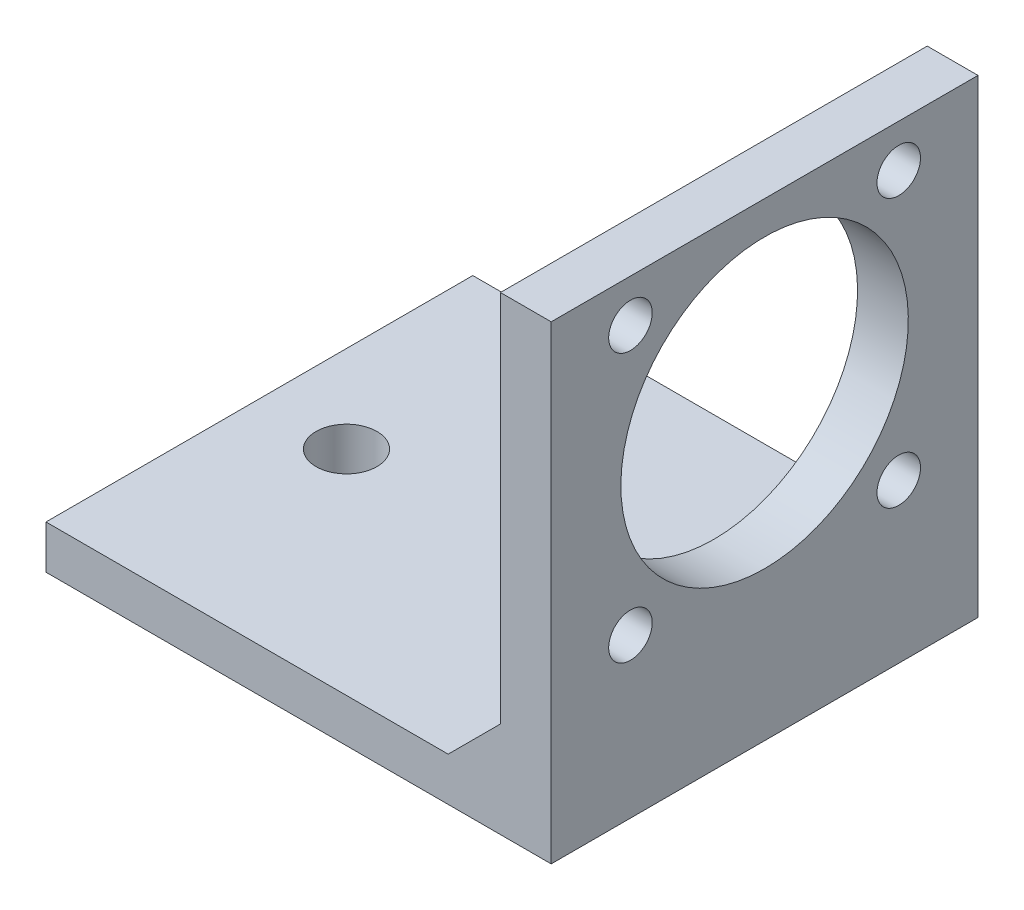
ISO-10303-21;
HEADER;
FILE_DESCRIPTION(('STEP AP214'),'2;1');
FILE_NAME('part.step','',(''),(''),'','','');
FILE_SCHEMA(('AUTOMOTIVE_DESIGN { 1 0 10303 214 1 1 1 1 }'));
ENDSEC;
DATA;
#1=APPLICATION_CONTEXT('core data for automotive mechanical design processes');
#2=APPLICATION_PROTOCOL_DEFINITION('international standard','automotive_design',2000,#1);
#3=PRODUCT_CONTEXT('',#1,'mechanical');
#4=PRODUCT('Part','Part','',(#3));
#5=PRODUCT_RELATED_PRODUCT_CATEGORY('part','',(#4));
#6=PRODUCT_DEFINITION_FORMATION('','',#4);
#7=PRODUCT_DEFINITION_CONTEXT('part definition',#1,'design');
#8=PRODUCT_DEFINITION('design','',#6,#7);
#9=PRODUCT_DEFINITION_SHAPE('','',#8);
#10=(LENGTH_UNIT() NAMED_UNIT(*) SI_UNIT(.MILLI.,.METRE.));
#11=(NAMED_UNIT(*) PLANE_ANGLE_UNIT() SI_UNIT($,.RADIAN.));
#12=(NAMED_UNIT(*) SI_UNIT($,.STERADIAN.) SOLID_ANGLE_UNIT());
#13=UNCERTAINTY_MEASURE_WITH_UNIT(LENGTH_MEASURE(1.E-05),#10,'distance_accuracy_value','');
#14=(GEOMETRIC_REPRESENTATION_CONTEXT(3) GLOBAL_UNCERTAINTY_ASSIGNED_CONTEXT((#13)) GLOBAL_UNIT_ASSIGNED_CONTEXT((#10,
#11,#12)) REPRESENTATION_CONTEXT('',''));
#15=CARTESIAN_POINT('',(0.,0.,0.));
#16=DIRECTION('',(0.,0.,1.));
#17=DIRECTION('',(1.,0.,0.));
#18=AXIS2_PLACEMENT_3D('',#15,#16,#17);
#19=CARTESIAN_POINT('',(26.085652445732,0.,24.5));
#20=DIRECTION('',(-1.,0.,0.));
#21=DIRECTION('',(0.,-1.,0.));
#22=AXIS2_PLACEMENT_3D('',#19,#20,#21);
#23=PLANE('',#22);
#24=DIRECTION('',(0.,1.,0.));
#25=VECTOR('',#24,1.);
#26=CARTESIAN_POINT('',(26.085652445732,0.,0.));
#27=LINE('',#26,#25);
#28=CARTESIAN_POINT('',(26.085652445732,5.5,0.));
#29=VERTEX_POINT('',#28);
#30=CARTESIAN_POINT('',(26.0856524457321,26.95,0.));
#31=VERTEX_POINT('',#30);
#32=EDGE_CURVE('E96',#29,#31,#27,.T.);
#33=ORIENTED_EDGE('',*,*,#32,.F.);
#34=DIRECTION('',(0.,0.,1.));
#35=VECTOR('',#34,1.);
#36=CARTESIAN_POINT('',(26.085652445732,5.5,24.5));
#37=LINE('',#36,#35);
#38=CARTESIAN_POINT('',(26.085652445732,5.5,24.5));
#39=VERTEX_POINT('',#38);
#40=EDGE_CURVE('E56',#29,#39,#37,.T.);
#41=ORIENTED_EDGE('',*,*,#40,.T.);
#42=DIRECTION('',(0.,1.,0.));
#43=VECTOR('',#42,1.);
#44=CARTESIAN_POINT('',(26.085652445732,0.,24.5));
#45=LINE('',#44,#43);
#46=CARTESIAN_POINT('',(26.0856524457321,26.95,24.5));
#47=VERTEX_POINT('',#46);
#48=EDGE_CURVE('E116',#39,#47,#45,.T.);
#49=ORIENTED_EDGE('',*,*,#48,.T.);
#50=DIRECTION('',(0.,0.,1.));
#51=VECTOR('',#50,1.);
#52=CARTESIAN_POINT('',(26.0856524457321,26.95,0.));
#53=LINE('',#52,#51);
#54=EDGE_CURVE('E109',#31,#47,#53,.T.);
#55=ORIENTED_EDGE('',*,*,#54,.F.);
#56=EDGE_LOOP('',(#33,#41,#49,#55));
#57=FACE_BOUND('',#56,.T.);
#58=CARTESIAN_POINT('',(26.0856524457321,16.8,12.25));
#59=DIRECTION('',(-1.,0.,0.));
#60=DIRECTION('',(0.,-1.,0.));
#61=AXIS2_PLACEMENT_3D('',#58,#59,#60);
#62=CIRCLE('',#61,8.24999999999999);
#63=CARTESIAN_POINT('',(26.0856524457321,8.55,12.25));
#64=VERTEX_POINT('',#63);
#65=EDGE_CURVE('E124',#64,#64,#62,.T.);
#66=ORIENTED_EDGE('',*,*,#65,.F.);
#67=EDGE_LOOP('',(#66));
#68=FACE_BOUND('',#67,.T.);
#69=CARTESIAN_POINT('',(26.085652445732,9.1,19.95));
#70=DIRECTION('',(-1.,0.,0.));
#71=DIRECTION('',(0.,-1.,0.));
#72=AXIS2_PLACEMENT_3D('',#69,#70,#71);
#73=CIRCLE('',#72,1.25);
#74=CARTESIAN_POINT('',(26.085652445732,7.85,19.95));
#75=VERTEX_POINT('',#74);
#76=EDGE_CURVE('E104',#75,#75,#73,.T.);
#77=ORIENTED_EDGE('',*,*,#76,.F.);
#78=EDGE_LOOP('',(#77));
#79=FACE_BOUND('',#78,.T.);
#80=CARTESIAN_POINT('',(26.085652445732,9.1,4.55));
#81=DIRECTION('',(-1.,0.,0.));
#82=DIRECTION('',(0.,-1.,0.));
#83=AXIS2_PLACEMENT_3D('',#80,#81,#82);
#84=CIRCLE('',#83,1.25);
#85=CARTESIAN_POINT('',(26.085652445732,7.85,4.55));
#86=VERTEX_POINT('',#85);
#87=EDGE_CURVE('E157',#86,#86,#84,.T.);
#88=ORIENTED_EDGE('',*,*,#87,.F.);
#89=EDGE_LOOP('',(#88));
#90=FACE_BOUND('',#89,.T.);
#91=CARTESIAN_POINT('',(26.0856524457321,24.5,4.55));
#92=DIRECTION('',(-1.,0.,0.));
#93=DIRECTION('',(0.,-1.,0.));
#94=AXIS2_PLACEMENT_3D('',#91,#92,#93);
#95=CIRCLE('',#94,1.25);
#96=CARTESIAN_POINT('',(26.0856524457321,23.25,4.55));
#97=VERTEX_POINT('',#96);
#98=EDGE_CURVE('E154',#97,#97,#95,.T.);
#99=ORIENTED_EDGE('',*,*,#98,.F.);
#100=EDGE_LOOP('',(#99));
#101=FACE_BOUND('',#100,.T.);
#102=CARTESIAN_POINT('',(26.0856524457321,24.5,19.95));
#103=DIRECTION('',(-1.,0.,0.));
#104=DIRECTION('',(0.,-1.,0.));
#105=AXIS2_PLACEMENT_3D('',#102,#103,#104);
#106=CIRCLE('',#105,1.25);
#107=CARTESIAN_POINT('',(26.0856524457321,23.25,19.95));
#108=VERTEX_POINT('',#107);
#109=EDGE_CURVE('E151',#108,#108,#106,.T.);
#110=ORIENTED_EDGE('',*,*,#109,.F.);
#111=EDGE_LOOP('',(#110));
#112=FACE_BOUND('',#111,.T.);
#113=ADVANCED_FACE('F40',(#57,#68,#79,#90,#101,#112),#23,.T.);
#114=CARTESIAN_POINT('',(0.,2.5,24.5));
#115=DIRECTION('',(0.,1.,0.));
#116=DIRECTION('',(-1.,0.,0.));
#117=AXIS2_PLACEMENT_3D('',#114,#115,#116);
#118=PLANE('',#117);
#119=CARTESIAN_POINT('',(5.,2.5,12.25));
#120=DIRECTION('',(0.,1.,0.));
#121=DIRECTION('',(-1.,0.,0.));
#122=AXIS2_PLACEMENT_3D('',#119,#120,#121);
#123=CIRCLE('',#122,1.75);
#124=CARTESIAN_POINT('',(3.25,2.5,12.25));
#125=VERTEX_POINT('',#124);
#126=EDGE_CURVE('E136',#125,#125,#123,.T.);
#127=ORIENTED_EDGE('',*,*,#126,.F.);
#128=EDGE_LOOP('',(#127));
#129=FACE_BOUND('',#128,.T.);
#130=CARTESIAN_POINT('',(20.,2.5,12.25));
#131=DIRECTION('',(0.,1.,0.));
#132=DIRECTION('',(-1.,0.,0.));
#133=AXIS2_PLACEMENT_3D('',#130,#131,#132);
#134=CIRCLE('',#133,1.75);
#135=CARTESIAN_POINT('',(18.25,2.5,12.25));
#136=VERTEX_POINT('',#135);
#137=EDGE_CURVE('E131',#136,#136,#134,.T.);
#138=ORIENTED_EDGE('',*,*,#137,.F.);
#139=EDGE_LOOP('',(#138));
#140=FACE_BOUND('',#139,.T.);
#141=DIRECTION('',(1.,0.,0.));
#142=VECTOR('',#141,1.);
#143=CARTESIAN_POINT('',(0.,2.5,24.5));
#144=LINE('',#143,#142);
#145=CARTESIAN_POINT('',(0.,2.5,24.5));
#146=VERTEX_POINT('',#145);
#147=CARTESIAN_POINT('',(23.085652445732,2.5,24.5));
#148=VERTEX_POINT('',#147);
#149=EDGE_CURVE('E163',#146,#148,#144,.T.);
#150=ORIENTED_EDGE('',*,*,#149,.T.);
#151=DIRECTION('',(0.,0.,-1.));
#152=VECTOR('',#151,1.);
#153=CARTESIAN_POINT('',(23.085652445732,2.5,0.));
#154=LINE('',#153,#152);
#155=CARTESIAN_POINT('',(23.085652445732,2.5,0.));
#156=VERTEX_POINT('',#155);
#157=EDGE_CURVE('E189',#148,#156,#154,.T.);
#158=ORIENTED_EDGE('',*,*,#157,.T.);
#159=DIRECTION('',(1.,0.,0.));
#160=VECTOR('',#159,1.);
#161=CARTESIAN_POINT('',(0.,2.5,0.));
#162=LINE('',#161,#160);
#163=CARTESIAN_POINT('',(0.,2.5,0.));
#164=VERTEX_POINT('',#163);
#165=EDGE_CURVE('E103',#164,#156,#162,.T.);
#166=ORIENTED_EDGE('',*,*,#165,.F.);
#167=DIRECTION('',(0.,0.,-1.));
#168=VECTOR('',#167,1.);
#169=CARTESIAN_POINT('',(0.,2.5,24.5));
#170=LINE('',#169,#168);
#171=EDGE_CURVE('E187',#146,#164,#170,.T.);
#172=ORIENTED_EDGE('',*,*,#171,.F.);
#173=EDGE_LOOP('',(#150,#158,#166,#172));
#174=FACE_BOUND('',#173,.T.);
#175=ADVANCED_FACE('F195',(#129,#140,#174),#118,.T.);
#176=CARTESIAN_POINT('',(0.,0.,24.5));
#177=DIRECTION('',(-1.,0.,0.));
#178=DIRECTION('',(0.,0.,1.));
#179=AXIS2_PLACEMENT_3D('',#176,#177,#178);
#180=PLANE('',#179);
#181=DIRECTION('',(0.,1.,0.));
#182=VECTOR('',#181,1.);
#183=CARTESIAN_POINT('',(0.,0.,0.));
#184=LINE('',#183,#182);
#185=CARTESIAN_POINT('',(0.,0.,0.));
#186=VERTEX_POINT('',#185);
#187=EDGE_CURVE('E177',#186,#164,#184,.T.);
#188=ORIENTED_EDGE('',*,*,#187,.F.);
#189=DIRECTION('',(0.,0.,-1.));
#190=VECTOR('',#189,1.);
#191=CARTESIAN_POINT('',(0.,0.,24.5));
#192=LINE('',#191,#190);
#193=CARTESIAN_POINT('',(0.,0.,24.5));
#194=VERTEX_POINT('',#193);
#195=EDGE_CURVE('E185',#194,#186,#192,.T.);
#196=ORIENTED_EDGE('',*,*,#195,.F.);
#197=DIRECTION('',(0.,1.,0.));
#198=VECTOR('',#197,1.);
#199=CARTESIAN_POINT('',(0.,0.,24.5));
#200=LINE('',#199,#198);
#201=EDGE_CURVE('E167',#194,#146,#200,.T.);
#202=ORIENTED_EDGE('',*,*,#201,.T.);
#203=ORIENTED_EDGE('',*,*,#171,.T.);
#204=EDGE_LOOP('',(#188,#196,#202,#203));
#205=FACE_BOUND('',#204,.T.);
#206=ADVANCED_FACE('F202',(#205),#180,.T.);
#207=CARTESIAN_POINT('',(0.,0.,24.5));
#208=DIRECTION('',(0.,1.,0.));
#209=DIRECTION('',(0.,0.,1.));
#210=AXIS2_PLACEMENT_3D('',#207,#208,#209);
#211=PLANE('',#210);
#212=CARTESIAN_POINT('',(5.,0.,12.25));
#213=DIRECTION('',(0.,1.,0.));
#214=DIRECTION('',(-1.,0.,0.));
#215=AXIS2_PLACEMENT_3D('',#212,#213,#214);
#216=CIRCLE('',#215,1.75);
#217=CARTESIAN_POINT('',(3.25,0.,12.25));
#218=VERTEX_POINT('',#217);
#219=EDGE_CURVE('E128',#218,#218,#216,.T.);
#220=ORIENTED_EDGE('',*,*,#219,.T.);
#221=EDGE_LOOP('',(#220));
#222=FACE_BOUND('',#221,.T.);
#223=CARTESIAN_POINT('',(20.,0.,12.25));
#224=DIRECTION('',(0.,1.,0.));
#225=DIRECTION('',(-1.,0.,0.));
#226=AXIS2_PLACEMENT_3D('',#223,#224,#225);
#227=CIRCLE('',#226,1.75);
#228=CARTESIAN_POINT('',(18.25,0.,12.25));
#229=VERTEX_POINT('',#228);
#230=EDGE_CURVE('E127',#229,#229,#227,.T.);
#231=ORIENTED_EDGE('',*,*,#230,.T.);
#232=EDGE_LOOP('',(#231));
#233=FACE_BOUND('',#232,.T.);
#234=DIRECTION('',(1.,0.,0.));
#235=VECTOR('',#234,1.);
#236=CARTESIAN_POINT('',(0.,0.,0.));
#237=LINE('',#236,#235);
#238=CARTESIAN_POINT('',(29.,0.,0.));
#239=VERTEX_POINT('',#238);
#240=EDGE_CURVE('E180',#186,#239,#237,.T.);
#241=ORIENTED_EDGE('',*,*,#240,.T.);
#242=DIRECTION('',(0.,0.,-1.));
#243=VECTOR('',#242,1.);
#244=CARTESIAN_POINT('',(29.,0.,24.5));
#245=LINE('',#244,#243);
#246=CARTESIAN_POINT('',(29.,0.,24.5));
#247=VERTEX_POINT('',#246);
#248=EDGE_CURVE('E174',#247,#239,#245,.T.);
#249=ORIENTED_EDGE('',*,*,#248,.F.);
#250=DIRECTION('',(1.,0.,0.));
#251=VECTOR('',#250,1.);
#252=CARTESIAN_POINT('',(0.,0.,24.5));
#253=LINE('',#252,#251);
#254=EDGE_CURVE('E170',#194,#247,#253,.T.);
#255=ORIENTED_EDGE('',*,*,#254,.F.);
#256=ORIENTED_EDGE('',*,*,#195,.T.);
#257=EDGE_LOOP('',(#241,#249,#255,#256));
#258=FACE_BOUND('',#257,.T.);
#259=ADVANCED_FACE('F222',(#222,#233,#258),#211,.F.);
#260=CARTESIAN_POINT('',(29.,0.,24.5));
#261=DIRECTION('',(-1.,0.,0.));
#262=DIRECTION('',(0.,0.,1.));
#263=AXIS2_PLACEMENT_3D('',#260,#261,#262);
#264=PLANE('',#263);
#265=CARTESIAN_POINT('',(29.,16.8,12.25));
#266=DIRECTION('',(-1.,0.,0.));
#267=DIRECTION('',(0.,-1.,0.));
#268=AXIS2_PLACEMENT_3D('',#265,#266,#267);
#269=CIRCLE('',#268,8.24999999999999);
#270=CARTESIAN_POINT('',(29.,8.55,12.25));
#271=VERTEX_POINT('',#270);
#272=EDGE_CURVE('E118',#271,#271,#269,.T.);
#273=ORIENTED_EDGE('',*,*,#272,.T.);
#274=EDGE_LOOP('',(#273));
#275=FACE_BOUND('',#274,.T.);
#276=CARTESIAN_POINT('',(29.,9.1,19.95));
#277=DIRECTION('',(1.,0.,0.));
#278=DIRECTION('',(0.,0.,-1.));
#279=AXIS2_PLACEMENT_3D('',#276,#277,#278);
#280=CIRCLE('',#279,1.25);
#281=CARTESIAN_POINT('',(29.,9.1,18.7));
#282=VERTEX_POINT('',#281);
#283=EDGE_CURVE('E139',#282,#282,#280,.T.);
#284=ORIENTED_EDGE('',*,*,#283,.F.);
#285=EDGE_LOOP('',(#284));
#286=FACE_BOUND('',#285,.T.);
#287=CARTESIAN_POINT('',(29.,9.1,4.55));
#288=DIRECTION('',(1.,0.,0.));
#289=DIRECTION('',(0.,0.,-1.));
#290=AXIS2_PLACEMENT_3D('',#287,#288,#289);
#291=CIRCLE('',#290,1.25);
#292=CARTESIAN_POINT('',(29.,9.1,3.3));
#293=VERTEX_POINT('',#292);
#294=EDGE_CURVE('E144',#293,#293,#291,.T.);
#295=ORIENTED_EDGE('',*,*,#294,.F.);
#296=EDGE_LOOP('',(#295));
#297=FACE_BOUND('',#296,.T.);
#298=CARTESIAN_POINT('',(29.,24.5,4.55));
#299=DIRECTION('',(1.,0.,0.));
#300=DIRECTION('',(0.,0.,-1.));
#301=AXIS2_PLACEMENT_3D('',#298,#299,#300);
#302=CIRCLE('',#301,1.25);
#303=CARTESIAN_POINT('',(29.,24.5,3.3));
#304=VERTEX_POINT('',#303);
#305=EDGE_CURVE('E140',#304,#304,#302,.T.);
#306=ORIENTED_EDGE('',*,*,#305,.F.);
#307=EDGE_LOOP('',(#306));
#308=FACE_BOUND('',#307,.T.);
#309=CARTESIAN_POINT('',(29.,24.5,19.95));
#310=DIRECTION('',(1.,0.,0.));
#311=DIRECTION('',(0.,0.,-1.));
#312=AXIS2_PLACEMENT_3D('',#309,#310,#311);
#313=CIRCLE('',#312,1.25);
#314=CARTESIAN_POINT('',(29.,24.5,18.7));
#315=VERTEX_POINT('',#314);
#316=EDGE_CURVE('E143',#315,#315,#313,.T.);
#317=ORIENTED_EDGE('',*,*,#316,.F.);
#318=EDGE_LOOP('',(#317));
#319=FACE_BOUND('',#318,.T.);
#320=DIRECTION('',(0.,1.,0.));
#321=VECTOR('',#320,1.);
#322=CARTESIAN_POINT('',(29.,0.,0.));
#323=LINE('',#322,#321);
#324=CARTESIAN_POINT('',(29.,26.95,0.));
#325=VERTEX_POINT('',#324);
#326=EDGE_CURVE('E164',#239,#325,#323,.T.);
#327=ORIENTED_EDGE('',*,*,#326,.T.);
#328=DIRECTION('',(0.,0.,1.));
#329=VECTOR('',#328,1.);
#330=CARTESIAN_POINT('',(29.,26.95,0.));
#331=LINE('',#330,#329);
#332=CARTESIAN_POINT('',(29.,26.95,24.5));
#333=VERTEX_POINT('',#332);
#334=EDGE_CURVE('E112',#325,#333,#331,.T.);
#335=ORIENTED_EDGE('',*,*,#334,.T.);
#336=DIRECTION('',(0.,1.,0.));
#337=VECTOR('',#336,1.);
#338=CARTESIAN_POINT('',(29.,0.,24.5));
#339=LINE('',#338,#337);
#340=EDGE_CURVE('E172',#247,#333,#339,.T.);
#341=ORIENTED_EDGE('',*,*,#340,.F.);
#342=ORIENTED_EDGE('',*,*,#248,.T.);
#343=EDGE_LOOP('',(#327,#335,#341,#342));
#344=FACE_BOUND('',#343,.T.);
#345=ADVANCED_FACE('F225',(#275,#286,#297,#308,#319,#344),#264,.F.);
#346=CARTESIAN_POINT('',(0.,0.,24.5));
#347=DIRECTION('',(0.,0.,1.));
#348=DIRECTION('',(1.,0.,0.));
#349=AXIS2_PLACEMENT_3D('',#346,#347,#348);
#350=PLANE('',#349);
#351=DIRECTION('',(1.,0.,0.));
#352=VECTOR('',#351,1.);
#353=CARTESIAN_POINT('',(26.0856524457321,26.95,24.5));
#354=LINE('',#353,#352);
#355=EDGE_CURVE('E113',#47,#333,#354,.T.);
#356=ORIENTED_EDGE('',*,*,#355,.F.);
#357=ORIENTED_EDGE('',*,*,#48,.F.);
#358=DIRECTION('',(0.707106781186551,0.707106781186544,0.));
#359=VECTOR('',#358,1.);
#360=CARTESIAN_POINT('',(23.085652445732,2.5,24.5));
#361=LINE('',#360,#359);
#362=EDGE_CURVE('E11',#39,#148,#361,.F.);
#363=ORIENTED_EDGE('',*,*,#362,.T.);
#364=ORIENTED_EDGE('',*,*,#149,.F.);
#365=ORIENTED_EDGE('',*,*,#201,.F.);
#366=ORIENTED_EDGE('',*,*,#254,.T.);
#367=ORIENTED_EDGE('',*,*,#340,.T.);
#368=EDGE_LOOP('',(#356,#357,#363,#364,#365,#366,#367));
#369=FACE_BOUND('',#368,.T.);
#370=ADVANCED_FACE('F206',(#369),#350,.T.);
#371=CARTESIAN_POINT('',(0.,0.,0.));
#372=DIRECTION('',(0.,0.,1.));
#373=DIRECTION('',(1.,0.,0.));
#374=AXIS2_PLACEMENT_3D('',#371,#372,#373);
#375=PLANE('',#374);
#376=ORIENTED_EDGE('',*,*,#165,.T.);
#377=DIRECTION('',(-0.707106781186551,-0.707106781186544,0.));
#378=VECTOR('',#377,1.);
#379=CARTESIAN_POINT('',(10.2928262228659,-10.292826222866,0.));
#380=LINE('',#379,#378);
#381=EDGE_CURVE('E49',#156,#29,#380,.F.);
#382=ORIENTED_EDGE('',*,*,#381,.T.);
#383=ORIENTED_EDGE('',*,*,#32,.T.);
#384=DIRECTION('',(1.,0.,0.));
#385=VECTOR('',#384,1.);
#386=CARTESIAN_POINT('',(26.0856524457321,26.95,0.));
#387=LINE('',#386,#385);
#388=EDGE_CURVE('E100',#31,#325,#387,.T.);
#389=ORIENTED_EDGE('',*,*,#388,.T.);
#390=ORIENTED_EDGE('',*,*,#326,.F.);
#391=ORIENTED_EDGE('',*,*,#240,.F.);
#392=ORIENTED_EDGE('',*,*,#187,.T.);
#393=EDGE_LOOP('',(#376,#382,#383,#389,#390,#391,#392));
#394=FACE_BOUND('',#393,.T.);
#395=ADVANCED_FACE('F98',(#394),#375,.F.);
#396=CARTESIAN_POINT('',(0.,24.5,19.95));
#397=DIRECTION('',(1.,0.,0.));
#398=DIRECTION('',(0.,0.,-1.));
#399=AXIS2_PLACEMENT_3D('',#396,#397,#398);
#400=CYLINDRICAL_SURFACE('',#399,1.25);
#401=ORIENTED_EDGE('',*,*,#109,.T.);
#402=EDGE_LOOP('',(#401));
#403=FACE_BOUND('',#402,.T.);
#404=ORIENTED_EDGE('',*,*,#316,.T.);
#405=EDGE_LOOP('',(#404));
#406=FACE_BOUND('',#405,.T.);
#407=ADVANCED_FACE('F232',(#403,#406),#400,.F.);
#408=CARTESIAN_POINT('',(0.,24.5,4.55));
#409=DIRECTION('',(1.,0.,0.));
#410=DIRECTION('',(0.,0.,-1.));
#411=AXIS2_PLACEMENT_3D('',#408,#409,#410);
#412=CYLINDRICAL_SURFACE('',#411,1.25);
#413=ORIENTED_EDGE('',*,*,#98,.T.);
#414=EDGE_LOOP('',(#413));
#415=FACE_BOUND('',#414,.T.);
#416=ORIENTED_EDGE('',*,*,#305,.T.);
#417=EDGE_LOOP('',(#416));
#418=FACE_BOUND('',#417,.T.);
#419=ADVANCED_FACE('F237',(#415,#418),#412,.F.);
#420=CARTESIAN_POINT('',(0.,9.1,4.55));
#421=DIRECTION('',(1.,0.,0.));
#422=DIRECTION('',(0.,0.,-1.));
#423=AXIS2_PLACEMENT_3D('',#420,#421,#422);
#424=CYLINDRICAL_SURFACE('',#423,1.25);
#425=ORIENTED_EDGE('',*,*,#87,.T.);
#426=EDGE_LOOP('',(#425));
#427=FACE_BOUND('',#426,.T.);
#428=ORIENTED_EDGE('',*,*,#294,.T.);
#429=EDGE_LOOP('',(#428));
#430=FACE_BOUND('',#429,.T.);
#431=ADVANCED_FACE('F243',(#427,#430),#424,.F.);
#432=CARTESIAN_POINT('',(0.,9.1,19.95));
#433=DIRECTION('',(1.,0.,0.));
#434=DIRECTION('',(0.,0.,-1.));
#435=AXIS2_PLACEMENT_3D('',#432,#433,#434);
#436=CYLINDRICAL_SURFACE('',#435,1.25);
#437=ORIENTED_EDGE('',*,*,#76,.T.);
#438=EDGE_LOOP('',(#437));
#439=FACE_BOUND('',#438,.T.);
#440=ORIENTED_EDGE('',*,*,#283,.T.);
#441=EDGE_LOOP('',(#440));
#442=FACE_BOUND('',#441,.T.);
#443=ADVANCED_FACE('F239',(#439,#442),#436,.F.);
#444=CARTESIAN_POINT('',(20.,0.,12.25));
#445=DIRECTION('',(0.,1.,0.));
#446=DIRECTION('',(-1.,0.,0.));
#447=AXIS2_PLACEMENT_3D('',#444,#445,#446);
#448=CYLINDRICAL_SURFACE('',#447,1.75);
#449=ORIENTED_EDGE('',*,*,#137,.T.);
#450=EDGE_LOOP('',(#449));
#451=FACE_BOUND('',#450,.T.);
#452=ORIENTED_EDGE('',*,*,#230,.F.);
#453=EDGE_LOOP('',(#452));
#454=FACE_BOUND('',#453,.T.);
#455=ADVANCED_FACE('F242',(#451,#454),#448,.F.);
#456=CARTESIAN_POINT('',(5.,0.,12.25));
#457=DIRECTION('',(0.,1.,0.));
#458=DIRECTION('',(-1.,0.,0.));
#459=AXIS2_PLACEMENT_3D('',#456,#457,#458);
#460=CYLINDRICAL_SURFACE('',#459,1.75);
#461=ORIENTED_EDGE('',*,*,#126,.T.);
#462=EDGE_LOOP('',(#461));
#463=FACE_BOUND('',#462,.T.);
#464=ORIENTED_EDGE('',*,*,#219,.F.);
#465=EDGE_LOOP('',(#464));
#466=FACE_BOUND('',#465,.T.);
#467=ADVANCED_FACE('F253',(#463,#466),#460,.F.);
#468=CARTESIAN_POINT('',(29.,16.8,12.25));
#469=DIRECTION('',(-1.,0.,0.));
#470=DIRECTION('',(0.,-1.,0.));
#471=AXIS2_PLACEMENT_3D('',#468,#469,#470);
#472=CYLINDRICAL_SURFACE('',#471,8.24999999999999);
#473=ORIENTED_EDGE('',*,*,#65,.T.);
#474=EDGE_LOOP('',(#473));
#475=FACE_BOUND('',#474,.T.);
#476=ORIENTED_EDGE('',*,*,#272,.F.);
#477=EDGE_LOOP('',(#476));
#478=FACE_BOUND('',#477,.T.);
#479=ADVANCED_FACE('F211',(#475,#478),#472,.F.);
#480=CARTESIAN_POINT('',(26.0856524457321,26.95,0.));
#481=DIRECTION('',(0.,-1.,0.));
#482=DIRECTION('',(0.,0.,-1.));
#483=AXIS2_PLACEMENT_3D('',#480,#481,#482);
#484=PLANE('',#483);
#485=ORIENTED_EDGE('',*,*,#355,.T.);
#486=ORIENTED_EDGE('',*,*,#334,.F.);
#487=ORIENTED_EDGE('',*,*,#388,.F.);
#488=ORIENTED_EDGE('',*,*,#54,.T.);
#489=EDGE_LOOP('',(#485,#486,#487,#488));
#490=FACE_BOUND('',#489,.T.);
#491=ADVANCED_FACE('F108',(#490),#484,.F.);
#492=CARTESIAN_POINT('',(23.085652445732,2.5,24.5));
#493=DIRECTION('',(-0.707106781186544,0.707106781186551,0.));
#494=DIRECTION('',(0.,0.,1.));
#495=AXIS2_PLACEMENT_3D('',#492,#493,#494);
#496=PLANE('',#495);
#497=ORIENTED_EDGE('',*,*,#362,.F.);
#498=ORIENTED_EDGE('',*,*,#40,.F.);
#499=ORIENTED_EDGE('',*,*,#381,.F.);
#500=ORIENTED_EDGE('',*,*,#157,.F.);
#501=EDGE_LOOP('',(#497,#498,#499,#500));
#502=FACE_BOUND('',#501,.T.);
#503=ADVANCED_FACE('F43',(#502),#496,.T.);
#504=CLOSED_SHELL('',(#113,#175,#206,#259,#345,#370,#395,#407,#419,#431,#443,#455,#467,#479,
#491,#503));
#505=MANIFOLD_SOLID_BREP('B2',#504);
#506=ADVANCED_BREP_SHAPE_REPRESENTATION('',(#18,#505),#14);
#507=SHAPE_DEFINITION_REPRESENTATION(#9,#506);
ENDSEC;
END-ISO-10303-21;
